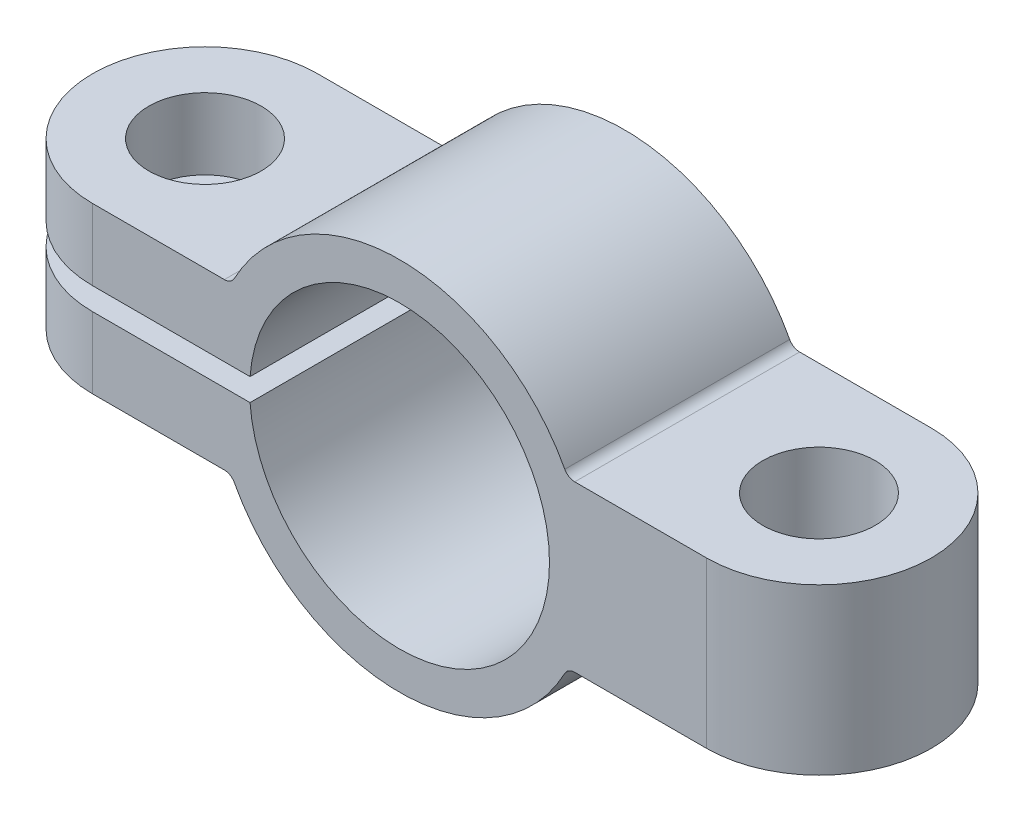
ISO-10303-21;
HEADER;
FILE_DESCRIPTION(('STEP AP214'),'2;1');
FILE_NAME('part.step','',(''),(''),'','','');
FILE_SCHEMA(('AUTOMOTIVE_DESIGN { 1 0 10303 214 1 1 1 1 }'));
ENDSEC;
DATA;
#1=APPLICATION_CONTEXT('core data for automotive mechanical design processes');
#2=APPLICATION_PROTOCOL_DEFINITION('international standard','automotive_design',2000,#1);
#3=PRODUCT_CONTEXT('',#1,'mechanical');
#4=PRODUCT('Part','Part','',(#3));
#5=PRODUCT_RELATED_PRODUCT_CATEGORY('part','',(#4));
#6=PRODUCT_DEFINITION_FORMATION('','',#4);
#7=PRODUCT_DEFINITION_CONTEXT('part definition',#1,'design');
#8=PRODUCT_DEFINITION('design','',#6,#7);
#9=PRODUCT_DEFINITION_SHAPE('','',#8);
#10=(LENGTH_UNIT() NAMED_UNIT(*) SI_UNIT(.MILLI.,.METRE.));
#11=(NAMED_UNIT(*) PLANE_ANGLE_UNIT() SI_UNIT($,.RADIAN.));
#12=(NAMED_UNIT(*) SI_UNIT($,.STERADIAN.) SOLID_ANGLE_UNIT());
#13=UNCERTAINTY_MEASURE_WITH_UNIT(LENGTH_MEASURE(1.E-05),#10,'distance_accuracy_value','');
#14=(GEOMETRIC_REPRESENTATION_CONTEXT(3) GLOBAL_UNCERTAINTY_ASSIGNED_CONTEXT((#13)) GLOBAL_UNIT_ASSIGNED_CONTEXT((#10,
#11,#12)) REPRESENTATION_CONTEXT('',''));
#15=CARTESIAN_POINT('',(0.,0.,0.));
#16=DIRECTION('',(0.,0.,1.));
#17=DIRECTION('',(1.,0.,0.));
#18=AXIS2_PLACEMENT_3D('',#15,#16,#17);
#19=CARTESIAN_POINT('',(0.,0.,6.));
#20=DIRECTION('',(0.,0.,-1.));
#21=DIRECTION('',(-1.,0.,0.));
#22=AXIS2_PLACEMENT_3D('',#19,#20,#21);
#23=PLANE('',#22);
#24=DIRECTION('',(0.,1.,0.));
#25=VECTOR('',#24,1.);
#26=CARTESIAN_POINT('',(8.18998886412873,-5.,6.));
#27=LINE('',#26,#25);
#28=CARTESIAN_POINT('',(8.18998886412873,-2.2,6.));
#29=VERTEX_POINT('',#28);
#30=CARTESIAN_POINT('',(8.18998886412873,2.2,6.));
#31=VERTEX_POINT('',#30);
#32=EDGE_CURVE('E150',#29,#31,#27,.T.);
#33=ORIENTED_EDGE('',*,*,#32,.T.);
#34=DIRECTION('',(-1.,0.,0.));
#35=VECTOR('',#34,1.);
#36=CARTESIAN_POINT('',(4.48998886412873,2.2,6.));
#37=LINE('',#36,#35);
#38=CARTESIAN_POINT('',(4.67332857821917,2.2,6.));
#39=VERTEX_POINT('',#38);
#40=EDGE_CURVE('E160',#31,#39,#37,.T.);
#41=ORIENTED_EDGE('',*,*,#40,.T.);
#42=CARTESIAN_POINT('',(4.67332857821917,2.5,6.));
#43=DIRECTION('',(0.,0.,-1.));
#44=DIRECTION('',(-1.,0.,0.));
#45=AXIS2_PLACEMENT_3D('',#42,#43,#44);
#46=CIRCLE('',#45,0.3);
#47=CARTESIAN_POINT('',(4.40880054548978,2.35849056603774,6.));
#48=VERTEX_POINT('',#47);
#49=EDGE_CURVE('E234',#39,#48,#46,.T.);
#50=ORIENTED_EDGE('',*,*,#49,.T.);
#51=CARTESIAN_POINT('',(0.,0.,6.));
#52=DIRECTION('',(0.,0.,1.));
#53=DIRECTION('',(-1.,0.,0.));
#54=AXIS2_PLACEMENT_3D('',#51,#52,#53);
#55=CIRCLE('',#54,5.);
#56=CARTESIAN_POINT('',(-4.40880054548978,2.35849056603774,6.));
#57=VERTEX_POINT('',#56);
#58=EDGE_CURVE('E169',#48,#57,#55,.T.);
#59=ORIENTED_EDGE('',*,*,#58,.T.);
#60=CARTESIAN_POINT('',(-4.67332857821917,2.5,6.));
#61=DIRECTION('',(0.,0.,-1.));
#62=DIRECTION('',(-1.,0.,0.));
#63=AXIS2_PLACEMENT_3D('',#60,#61,#62);
#64=CIRCLE('',#63,0.3);
#65=CARTESIAN_POINT('',(-4.67332857821917,2.2,6.));
#66=VERTEX_POINT('',#65);
#67=EDGE_CURVE('E11',#57,#66,#64,.T.);
#68=ORIENTED_EDGE('',*,*,#67,.T.);
#69=DIRECTION('',(-1.,0.,0.));
#70=VECTOR('',#69,1.);
#71=CARTESIAN_POINT('',(-11.1899888641287,2.2,6.));
#72=LINE('',#71,#70);
#73=CARTESIAN_POINT('',(-8.18998886412873,2.2,6.));
#74=VERTEX_POINT('',#73);
#75=EDGE_CURVE('E192',#66,#74,#72,.T.);
#76=ORIENTED_EDGE('',*,*,#75,.T.);
#77=DIRECTION('',(0.,1.,0.));
#78=VECTOR('',#77,1.);
#79=CARTESIAN_POINT('',(-8.18998886412873,-5.,6.));
#80=LINE('',#79,#78);
#81=CARTESIAN_POINT('',(-8.18998886412873,0.3,6.));
#82=VERTEX_POINT('',#81);
#83=EDGE_CURVE('E285',#82,#74,#80,.T.);
#84=ORIENTED_EDGE('',*,*,#83,.F.);
#85=DIRECTION('',(1.,0.,0.));
#86=VECTOR('',#85,1.);
#87=CARTESIAN_POINT('',(-11.1899888641287,0.3,6.));
#88=LINE('',#87,#86);
#89=CARTESIAN_POINT('',(-3.98873413503583,0.3,6.));
#90=VERTEX_POINT('',#89);
#91=EDGE_CURVE('E175',#82,#90,#88,.T.);
#92=ORIENTED_EDGE('',*,*,#91,.T.);
#93=CARTESIAN_POINT('',(0.,0.,6.));
#94=DIRECTION('',(0.,0.,-1.));
#95=DIRECTION('',(1.,0.,0.));
#96=AXIS2_PLACEMENT_3D('',#93,#94,#95);
#97=CIRCLE('',#96,4.);
#98=CARTESIAN_POINT('',(-3.98873413503583,-0.3,6.));
#99=VERTEX_POINT('',#98);
#100=EDGE_CURVE('E170',#90,#99,#97,.T.);
#101=ORIENTED_EDGE('',*,*,#100,.T.);
#102=DIRECTION('',(1.,0.,0.));
#103=VECTOR('',#102,1.);
#104=CARTESIAN_POINT('',(-11.1899888641287,-0.3,6.));
#105=LINE('',#104,#103);
#106=CARTESIAN_POINT('',(-8.18998886412873,-0.3,6.));
#107=VERTEX_POINT('',#106);
#108=EDGE_CURVE('E255',#107,#99,#105,.T.);
#109=ORIENTED_EDGE('',*,*,#108,.F.);
#110=CARTESIAN_POINT('',(-8.18998886412873,-2.2,6.));
#111=VERTEX_POINT('',#110);
#112=EDGE_CURVE('E284',#111,#107,#80,.T.);
#113=ORIENTED_EDGE('',*,*,#112,.F.);
#114=DIRECTION('',(-1.,0.,0.));
#115=VECTOR('',#114,1.);
#116=CARTESIAN_POINT('',(-11.1899888641287,-2.2,6.));
#117=LINE('',#116,#115);
#118=CARTESIAN_POINT('',(-4.67332857821917,-2.2,6.));
#119=VERTEX_POINT('',#118);
#120=EDGE_CURVE('E258',#119,#111,#117,.T.);
#121=ORIENTED_EDGE('',*,*,#120,.F.);
#122=CARTESIAN_POINT('',(-4.67332857821917,-2.5,6.));
#123=DIRECTION('',(0.,0.,-1.));
#124=DIRECTION('',(-1.,0.,0.));
#125=AXIS2_PLACEMENT_3D('',#122,#123,#124);
#126=CIRCLE('',#125,0.3);
#127=CARTESIAN_POINT('',(-4.40880054548978,-2.35849056603774,6.));
#128=VERTEX_POINT('',#127);
#129=EDGE_CURVE('E230',#119,#128,#126,.T.);
#130=ORIENTED_EDGE('',*,*,#129,.T.);
#131=CARTESIAN_POINT('',(0.,0.,6.));
#132=DIRECTION('',(0.,0.,-1.));
#133=DIRECTION('',(-1.,0.,0.));
#134=AXIS2_PLACEMENT_3D('',#131,#132,#133);
#135=CIRCLE('',#134,5.);
#136=CARTESIAN_POINT('',(4.40880054548978,-2.35849056603774,6.));
#137=VERTEX_POINT('',#136);
#138=EDGE_CURVE('E270',#137,#128,#135,.T.);
#139=ORIENTED_EDGE('',*,*,#138,.F.);
#140=CARTESIAN_POINT('',(4.67332857821917,-2.5,6.));
#141=DIRECTION('',(0.,0.,-1.));
#142=DIRECTION('',(-1.,0.,0.));
#143=AXIS2_PLACEMENT_3D('',#140,#141,#142);
#144=CIRCLE('',#143,0.3);
#145=CARTESIAN_POINT('',(4.67332857821917,-2.2,6.));
#146=VERTEX_POINT('',#145);
#147=EDGE_CURVE('E226',#137,#146,#144,.T.);
#148=ORIENTED_EDGE('',*,*,#147,.T.);
#149=DIRECTION('',(-1.,0.,0.));
#150=VECTOR('',#149,1.);
#151=CARTESIAN_POINT('',(4.48998886412873,-2.2,6.));
#152=LINE('',#151,#150);
#153=EDGE_CURVE('E163',#29,#146,#152,.T.);
#154=ORIENTED_EDGE('',*,*,#153,.F.);
#155=EDGE_LOOP('',(#33,#41,#50,#59,#68,#76,#84,#92,#101,#109,#113,#121,#130,#139,#148,#154));
#156=FACE_BOUND('',#155,.T.);
#157=ADVANCED_FACE('F35',(#156),#23,.F.);
#158=CARTESIAN_POINT('',(0.,0.,0.));
#159=DIRECTION('',(0.,0.,-1.));
#160=DIRECTION('',(-1.,0.,0.));
#161=AXIS2_PLACEMENT_3D('',#158,#159,#160);
#162=PLANE('',#161);
#163=DIRECTION('',(-1.,0.,0.));
#164=VECTOR('',#163,1.);
#165=CARTESIAN_POINT('',(4.48998886412873,2.2,0.));
#166=LINE('',#165,#164);
#167=CARTESIAN_POINT('',(8.18998886412873,2.2,0.));
#168=VERTEX_POINT('',#167);
#169=CARTESIAN_POINT('',(4.67332857821917,2.2,0.));
#170=VERTEX_POINT('',#169);
#171=EDGE_CURVE('E187',#168,#170,#166,.T.);
#172=ORIENTED_EDGE('',*,*,#171,.F.);
#173=DIRECTION('',(0.,1.,0.));
#174=VECTOR('',#173,1.);
#175=CARTESIAN_POINT('',(8.18998886412873,-5.,0.));
#176=LINE('',#175,#174);
#177=CARTESIAN_POINT('',(8.18998886412873,-2.2,0.));
#178=VERTEX_POINT('',#177);
#179=EDGE_CURVE('E153',#178,#168,#176,.T.);
#180=ORIENTED_EDGE('',*,*,#179,.F.);
#181=DIRECTION('',(-1.,0.,0.));
#182=VECTOR('',#181,1.);
#183=CARTESIAN_POINT('',(4.48998886412873,-2.2,0.));
#184=LINE('',#183,#182);
#185=CARTESIAN_POINT('',(4.67332857821917,-2.2,0.));
#186=VERTEX_POINT('',#185);
#187=EDGE_CURVE('E259',#178,#186,#184,.T.);
#188=ORIENTED_EDGE('',*,*,#187,.T.);
#189=CARTESIAN_POINT('',(4.67332857821917,-2.5,0.));
#190=DIRECTION('',(0.,0.,-1.));
#191=DIRECTION('',(-1.,0.,0.));
#192=AXIS2_PLACEMENT_3D('',#189,#190,#191);
#193=CIRCLE('',#192,0.3);
#194=CARTESIAN_POINT('',(4.40880054548978,-2.35849056603774,0.));
#195=VERTEX_POINT('',#194);
#196=EDGE_CURVE('E224',#186,#195,#193,.F.);
#197=ORIENTED_EDGE('',*,*,#196,.T.);
#198=CARTESIAN_POINT('',(0.,0.,0.));
#199=DIRECTION('',(0.,0.,-1.));
#200=DIRECTION('',(-1.,0.,0.));
#201=AXIS2_PLACEMENT_3D('',#198,#199,#200);
#202=CIRCLE('',#201,5.);
#203=CARTESIAN_POINT('',(-4.40880054548978,-2.35849056603774,0.));
#204=VERTEX_POINT('',#203);
#205=EDGE_CURVE('E262',#195,#204,#202,.T.);
#206=ORIENTED_EDGE('',*,*,#205,.T.);
#207=CARTESIAN_POINT('',(-4.67332857821917,-2.5,0.));
#208=DIRECTION('',(0.,0.,-1.));
#209=DIRECTION('',(-1.,0.,0.));
#210=AXIS2_PLACEMENT_3D('',#207,#208,#209);
#211=CIRCLE('',#210,0.3);
#212=CARTESIAN_POINT('',(-4.67332857821917,-2.2,0.));
#213=VERTEX_POINT('',#212);
#214=EDGE_CURVE('E228',#204,#213,#211,.F.);
#215=ORIENTED_EDGE('',*,*,#214,.T.);
#216=DIRECTION('',(-1.,0.,0.));
#217=VECTOR('',#216,1.);
#218=CARTESIAN_POINT('',(-11.1899888641287,-2.2,0.));
#219=LINE('',#218,#217);
#220=CARTESIAN_POINT('',(-8.18998886412873,-2.2,0.));
#221=VERTEX_POINT('',#220);
#222=EDGE_CURVE('E265',#213,#221,#219,.T.);
#223=ORIENTED_EDGE('',*,*,#222,.T.);
#224=DIRECTION('',(0.,1.,0.));
#225=VECTOR('',#224,1.);
#226=CARTESIAN_POINT('',(-8.18998886412873,-5.,0.));
#227=LINE('',#226,#225);
#228=CARTESIAN_POINT('',(-8.18998886412873,-0.3,0.));
#229=VERTEX_POINT('',#228);
#230=EDGE_CURVE('E280',#221,#229,#227,.T.);
#231=ORIENTED_EDGE('',*,*,#230,.T.);
#232=DIRECTION('',(1.,0.,0.));
#233=VECTOR('',#232,1.);
#234=CARTESIAN_POINT('',(-11.1899888641287,-0.3,0.));
#235=LINE('',#234,#233);
#236=CARTESIAN_POINT('',(-3.98873413503583,-0.3,0.));
#237=VERTEX_POINT('',#236);
#238=EDGE_CURVE('E256',#229,#237,#235,.T.);
#239=ORIENTED_EDGE('',*,*,#238,.T.);
#240=CARTESIAN_POINT('',(0.,0.,0.));
#241=DIRECTION('',(0.,0.,-1.));
#242=DIRECTION('',(1.,0.,0.));
#243=AXIS2_PLACEMENT_3D('',#240,#241,#242);
#244=CIRCLE('',#243,4.);
#245=CARTESIAN_POINT('',(-3.98873413503583,0.3,0.));
#246=VERTEX_POINT('',#245);
#247=EDGE_CURVE('E184',#246,#237,#244,.T.);
#248=ORIENTED_EDGE('',*,*,#247,.F.);
#249=DIRECTION('',(1.,0.,0.));
#250=VECTOR('',#249,1.);
#251=CARTESIAN_POINT('',(-11.1899888641287,0.3,0.));
#252=LINE('',#251,#250);
#253=CARTESIAN_POINT('',(-8.18998886412873,0.3,0.));
#254=VERTEX_POINT('',#253);
#255=EDGE_CURVE('E181',#254,#246,#252,.T.);
#256=ORIENTED_EDGE('',*,*,#255,.F.);
#257=CARTESIAN_POINT('',(-8.18998886412873,2.2,0.));
#258=VERTEX_POINT('',#257);
#259=EDGE_CURVE('E281',#254,#258,#227,.T.);
#260=ORIENTED_EDGE('',*,*,#259,.T.);
#261=DIRECTION('',(-1.,0.,0.));
#262=VECTOR('',#261,1.);
#263=CARTESIAN_POINT('',(-11.1899888641287,2.2,0.));
#264=LINE('',#263,#262);
#265=CARTESIAN_POINT('',(-4.67332857821917,2.2,0.));
#266=VERTEX_POINT('',#265);
#267=EDGE_CURVE('E179',#266,#258,#264,.T.);
#268=ORIENTED_EDGE('',*,*,#267,.F.);
#269=CARTESIAN_POINT('',(-4.67332857821917,2.5,0.));
#270=DIRECTION('',(0.,0.,-1.));
#271=DIRECTION('',(-1.,0.,0.));
#272=AXIS2_PLACEMENT_3D('',#269,#270,#271);
#273=CIRCLE('',#272,0.3);
#274=CARTESIAN_POINT('',(-4.40880054548978,2.35849056603774,0.));
#275=VERTEX_POINT('',#274);
#276=EDGE_CURVE('E43',#266,#275,#273,.F.);
#277=ORIENTED_EDGE('',*,*,#276,.T.);
#278=CARTESIAN_POINT('',(0.,0.,0.));
#279=DIRECTION('',(0.,0.,1.));
#280=DIRECTION('',(-1.,0.,0.));
#281=AXIS2_PLACEMENT_3D('',#278,#279,#280);
#282=CIRCLE('',#281,5.);
#283=CARTESIAN_POINT('',(4.40880054548978,2.35849056603774,0.));
#284=VERTEX_POINT('',#283);
#285=EDGE_CURVE('E189',#284,#275,#282,.T.);
#286=ORIENTED_EDGE('',*,*,#285,.F.);
#287=CARTESIAN_POINT('',(4.67332857821917,2.5,0.));
#288=DIRECTION('',(0.,0.,-1.));
#289=DIRECTION('',(-1.,0.,0.));
#290=AXIS2_PLACEMENT_3D('',#287,#288,#289);
#291=CIRCLE('',#290,0.3);
#292=EDGE_CURVE('E232',#284,#170,#291,.F.);
#293=ORIENTED_EDGE('',*,*,#292,.T.);
#294=EDGE_LOOP('',(#172,#180,#188,#197,#206,#215,#223,#231,#239,#248,#256,#260,#268,#277,#286,#293));
#295=FACE_BOUND('',#294,.T.);
#296=ADVANCED_FACE('F238',(#295),#162,.T.);
#297=CARTESIAN_POINT('',(-11.1899888641287,2.2,6.));
#298=DIRECTION('',(0.,-1.,0.));
#299=DIRECTION('',(0.,0.,-1.));
#300=AXIS2_PLACEMENT_3D('',#297,#298,#299);
#301=PLANE('',#300);
#302=CARTESIAN_POINT('',(-8.18998886412873,2.2,3.));
#303=DIRECTION('',(0.,1.,0.));
#304=DIRECTION('',(-1.,0.,0.));
#305=AXIS2_PLACEMENT_3D('',#302,#303,#304);
#306=CIRCLE('',#305,1.5);
#307=CARTESIAN_POINT('',(-9.68998886412873,2.2,3.));
#308=VERTEX_POINT('',#307);
#309=EDGE_CURVE('E202',#308,#308,#306,.T.);
#310=ORIENTED_EDGE('',*,*,#309,.F.);
#311=EDGE_LOOP('',(#310));
#312=FACE_BOUND('',#311,.T.);
#313=ORIENTED_EDGE('',*,*,#75,.F.);
#314=DIRECTION('',(0.,0.,1.));
#315=VECTOR('',#314,1.);
#316=CARTESIAN_POINT('',(-4.67332857821917,2.2,0.));
#317=LINE('',#316,#315);
#318=EDGE_CURVE('E222',#66,#266,#317,.F.);
#319=ORIENTED_EDGE('',*,*,#318,.T.);
#320=ORIENTED_EDGE('',*,*,#267,.T.);
#321=CARTESIAN_POINT('',(-8.18998886412873,2.2,3.));
#322=DIRECTION('',(0.,1.,0.));
#323=DIRECTION('',(-1.,0.,0.));
#324=AXIS2_PLACEMENT_3D('',#321,#322,#323);
#325=CIRCLE('',#324,3.);
#326=EDGE_CURVE('E248',#258,#74,#325,.T.);
#327=ORIENTED_EDGE('',*,*,#326,.T.);
#328=EDGE_LOOP('',(#313,#319,#320,#327));
#329=FACE_BOUND('',#328,.T.);
#330=ADVANCED_FACE('F245',(#312,#329),#301,.F.);
#331=CARTESIAN_POINT('',(-11.1899888641287,0.3,6.));
#332=DIRECTION('',(0.,1.,0.));
#333=DIRECTION('',(0.,0.,1.));
#334=AXIS2_PLACEMENT_3D('',#331,#332,#333);
#335=PLANE('',#334);
#336=CARTESIAN_POINT('',(-8.18998886412873,0.3,3.));
#337=DIRECTION('',(0.,1.,0.));
#338=DIRECTION('',(0.,0.,1.));
#339=AXIS2_PLACEMENT_3D('',#336,#337,#338);
#340=CIRCLE('',#339,1.5);
#341=CARTESIAN_POINT('',(-8.18998886412873,0.3,4.5));
#342=VERTEX_POINT('',#341);
#343=EDGE_CURVE('E164',#342,#342,#340,.T.);
#344=ORIENTED_EDGE('',*,*,#343,.T.);
#345=EDGE_LOOP('',(#344));
#346=FACE_BOUND('',#345,.T.);
#347=ORIENTED_EDGE('',*,*,#91,.F.);
#348=CARTESIAN_POINT('',(-8.18998886412873,0.3,3.));
#349=DIRECTION('',(0.,1.,0.));
#350=DIRECTION('',(0.,0.,1.));
#351=AXIS2_PLACEMENT_3D('',#348,#349,#350);
#352=CIRCLE('',#351,3.);
#353=EDGE_CURVE('E267',#254,#82,#352,.T.);
#354=ORIENTED_EDGE('',*,*,#353,.F.);
#355=ORIENTED_EDGE('',*,*,#255,.T.);
#356=DIRECTION('',(0.,0.,-1.));
#357=VECTOR('',#356,1.);
#358=CARTESIAN_POINT('',(-3.98873413503583,0.3,6.));
#359=LINE('',#358,#357);
#360=EDGE_CURVE('E172',#90,#246,#359,.T.);
#361=ORIENTED_EDGE('',*,*,#360,.F.);
#362=EDGE_LOOP('',(#347,#354,#355,#361));
#363=FACE_BOUND('',#362,.T.);
#364=ADVANCED_FACE('F321',(#346,#363),#335,.F.);
#365=CARTESIAN_POINT('',(-11.1899888641287,-2.2,6.));
#366=DIRECTION('',(0.,-1.,0.));
#367=DIRECTION('',(0.,0.,-1.));
#368=AXIS2_PLACEMENT_3D('',#365,#366,#367);
#369=PLANE('',#368);
#370=CARTESIAN_POINT('',(-8.18998886412873,-2.2,3.));
#371=DIRECTION('',(0.,-1.,0.));
#372=DIRECTION('',(0.,0.,-1.));
#373=AXIS2_PLACEMENT_3D('',#370,#371,#372);
#374=CIRCLE('',#373,1.5);
#375=CARTESIAN_POINT('',(-8.18998886412873,-2.2,1.5));
#376=VERTEX_POINT('',#375);
#377=EDGE_CURVE('E201',#376,#376,#374,.T.);
#378=ORIENTED_EDGE('',*,*,#377,.F.);
#379=EDGE_LOOP('',(#378));
#380=FACE_BOUND('',#379,.T.);
#381=ORIENTED_EDGE('',*,*,#222,.F.);
#382=DIRECTION('',(0.,0.,1.));
#383=VECTOR('',#382,1.);
#384=CARTESIAN_POINT('',(-4.67332857821917,-2.2,6.));
#385=LINE('',#384,#383);
#386=EDGE_CURVE('E214',#213,#119,#385,.T.);
#387=ORIENTED_EDGE('',*,*,#386,.T.);
#388=ORIENTED_EDGE('',*,*,#120,.T.);
#389=CARTESIAN_POINT('',(-8.18998886412873,-2.2,3.));
#390=DIRECTION('',(0.,-1.,0.));
#391=DIRECTION('',(0.,0.,-1.));
#392=AXIS2_PLACEMENT_3D('',#389,#390,#391);
#393=CIRCLE('',#392,3.);
#394=EDGE_CURVE('E275',#111,#221,#393,.T.);
#395=ORIENTED_EDGE('',*,*,#394,.T.);
#396=EDGE_LOOP('',(#381,#387,#388,#395));
#397=FACE_BOUND('',#396,.T.);
#398=ADVANCED_FACE('F318',(#380,#397),#369,.T.);
#399=CARTESIAN_POINT('',(-11.1899888641287,-0.3,6.));
#400=DIRECTION('',(0.,1.,0.));
#401=DIRECTION('',(0.,0.,1.));
#402=AXIS2_PLACEMENT_3D('',#399,#400,#401);
#403=PLANE('',#402);
#404=CARTESIAN_POINT('',(-8.18998886412873,-0.3,3.));
#405=DIRECTION('',(0.,1.,0.));
#406=DIRECTION('',(0.,0.,1.));
#407=AXIS2_PLACEMENT_3D('',#404,#405,#406);
#408=CIRCLE('',#407,1.5);
#409=CARTESIAN_POINT('',(-8.18998886412873,-0.3,4.5));
#410=VERTEX_POINT('',#409);
#411=EDGE_CURVE('E198',#410,#410,#408,.T.);
#412=ORIENTED_EDGE('',*,*,#411,.F.);
#413=EDGE_LOOP('',(#412));
#414=FACE_BOUND('',#413,.T.);
#415=CARTESIAN_POINT('',(-8.18998886412873,-0.3,3.));
#416=DIRECTION('',(0.,1.,0.));
#417=DIRECTION('',(0.,0.,1.));
#418=AXIS2_PLACEMENT_3D('',#415,#416,#417);
#419=CIRCLE('',#418,3.);
#420=EDGE_CURVE('E278',#229,#107,#419,.T.);
#421=ORIENTED_EDGE('',*,*,#420,.T.);
#422=ORIENTED_EDGE('',*,*,#108,.T.);
#423=DIRECTION('',(0.,0.,-1.));
#424=VECTOR('',#423,1.);
#425=CARTESIAN_POINT('',(-3.98873413503583,-0.3,6.));
#426=LINE('',#425,#424);
#427=EDGE_CURVE('E182',#99,#237,#426,.T.);
#428=ORIENTED_EDGE('',*,*,#427,.T.);
#429=ORIENTED_EDGE('',*,*,#238,.F.);
#430=EDGE_LOOP('',(#421,#422,#428,#429));
#431=FACE_BOUND('',#430,.T.);
#432=ADVANCED_FACE('F308',(#414,#431),#403,.T.);
#433=CARTESIAN_POINT('',(0.,0.,6.));
#434=DIRECTION('',(0.,0.,-1.));
#435=DIRECTION('',(-1.,0.,0.));
#436=AXIS2_PLACEMENT_3D('',#433,#434,#435);
#437=CYLINDRICAL_SURFACE('',#436,4.);
#438=ORIENTED_EDGE('',*,*,#247,.T.);
#439=ORIENTED_EDGE('',*,*,#427,.F.);
#440=ORIENTED_EDGE('',*,*,#100,.F.);
#441=ORIENTED_EDGE('',*,*,#360,.T.);
#442=EDGE_LOOP('',(#438,#439,#440,#441));
#443=FACE_BOUND('',#442,.T.);
#444=ADVANCED_FACE('F300',(#443),#437,.F.);
#445=CARTESIAN_POINT('',(4.48998886412873,2.2,6.));
#446=DIRECTION('',(0.,-1.,0.));
#447=DIRECTION('',(0.,0.,-1.));
#448=AXIS2_PLACEMENT_3D('',#445,#446,#447);
#449=PLANE('',#448);
#450=CARTESIAN_POINT('',(8.18998886412873,2.2,3.));
#451=DIRECTION('',(0.,1.,0.));
#452=DIRECTION('',(-1.,0.,0.));
#453=AXIS2_PLACEMENT_3D('',#450,#451,#452);
#454=CIRCLE('',#453,1.5);
#455=CARTESIAN_POINT('',(6.68998886412873,2.2,3.));
#456=VERTEX_POINT('',#455);
#457=EDGE_CURVE('E206',#456,#456,#454,.T.);
#458=ORIENTED_EDGE('',*,*,#457,.F.);
#459=EDGE_LOOP('',(#458));
#460=FACE_BOUND('',#459,.T.);
#461=ORIENTED_EDGE('',*,*,#171,.T.);
#462=DIRECTION('',(0.,0.,1.));
#463=VECTOR('',#462,1.);
#464=CARTESIAN_POINT('',(4.67332857821917,2.2,6.));
#465=LINE('',#464,#463);
#466=EDGE_CURVE('E168',#170,#39,#465,.T.);
#467=ORIENTED_EDGE('',*,*,#466,.T.);
#468=ORIENTED_EDGE('',*,*,#40,.F.);
#469=CARTESIAN_POINT('',(8.18998886412873,2.2,3.));
#470=DIRECTION('',(0.,-1.,0.));
#471=DIRECTION('',(1.,0.,0.));
#472=AXIS2_PLACEMENT_3D('',#469,#470,#471);
#473=CIRCLE('',#472,3.);
#474=EDGE_CURVE('E147',#168,#31,#473,.T.);
#475=ORIENTED_EDGE('',*,*,#474,.F.);
#476=EDGE_LOOP('',(#461,#467,#468,#475));
#477=FACE_BOUND('',#476,.T.);
#478=ADVANCED_FACE('F166',(#460,#477),#449,.F.);
#479=CARTESIAN_POINT('',(0.,0.,6.));
#480=DIRECTION('',(0.,0.,-1.));
#481=DIRECTION('',(-1.,0.,0.));
#482=AXIS2_PLACEMENT_3D('',#479,#480,#481);
#483=CYLINDRICAL_SURFACE('',#482,5.);
#484=ORIENTED_EDGE('',*,*,#58,.F.);
#485=DIRECTION('',(0.,0.,-1.));
#486=VECTOR('',#485,1.);
#487=CARTESIAN_POINT('',(4.40880054548978,2.35849056603774,6.));
#488=LINE('',#487,#486);
#489=EDGE_CURVE('E218',#48,#284,#488,.T.);
#490=ORIENTED_EDGE('',*,*,#489,.T.);
#491=ORIENTED_EDGE('',*,*,#285,.T.);
#492=DIRECTION('',(0.,0.,-1.));
#493=VECTOR('',#492,1.);
#494=CARTESIAN_POINT('',(-4.40880054548978,2.35849056603774,6.));
#495=LINE('',#494,#493);
#496=EDGE_CURVE('E216',#275,#57,#495,.F.);
#497=ORIENTED_EDGE('',*,*,#496,.T.);
#498=EDGE_LOOP('',(#484,#490,#491,#497));
#499=FACE_BOUND('',#498,.T.);
#500=ADVANCED_FACE('F242',(#499),#483,.T.);
#501=CARTESIAN_POINT('',(0.,0.,6.));
#502=DIRECTION('',(0.,0.,-1.));
#503=DIRECTION('',(-1.,0.,0.));
#504=AXIS2_PLACEMENT_3D('',#501,#502,#503);
#505=CYLINDRICAL_SURFACE('',#504,5.);
#506=ORIENTED_EDGE('',*,*,#205,.F.);
#507=DIRECTION('',(0.,0.,-1.));
#508=VECTOR('',#507,1.);
#509=CARTESIAN_POINT('',(4.40880054548978,-2.35849056603774,6.));
#510=LINE('',#509,#508);
#511=EDGE_CURVE('E212',#195,#137,#510,.F.);
#512=ORIENTED_EDGE('',*,*,#511,.T.);
#513=ORIENTED_EDGE('',*,*,#138,.T.);
#514=DIRECTION('',(0.,0.,-1.));
#515=VECTOR('',#514,1.);
#516=CARTESIAN_POINT('',(-4.40880054548978,-2.35849056603774,6.));
#517=LINE('',#516,#515);
#518=EDGE_CURVE('E209',#128,#204,#517,.T.);
#519=ORIENTED_EDGE('',*,*,#518,.T.);
#520=EDGE_LOOP('',(#506,#512,#513,#519));
#521=FACE_BOUND('',#520,.T.);
#522=ADVANCED_FACE('F306',(#521),#505,.T.);
#523=CARTESIAN_POINT('',(4.48998886412873,-2.2,6.));
#524=DIRECTION('',(0.,-1.,0.));
#525=DIRECTION('',(0.,0.,-1.));
#526=AXIS2_PLACEMENT_3D('',#523,#524,#525);
#527=PLANE('',#526);
#528=CARTESIAN_POINT('',(8.18998886412873,-2.2,3.));
#529=DIRECTION('',(0.,-1.,0.));
#530=DIRECTION('',(0.,0.,-1.));
#531=AXIS2_PLACEMENT_3D('',#528,#529,#530);
#532=CIRCLE('',#531,1.5);
#533=CARTESIAN_POINT('',(8.18998886412873,-2.2,1.5));
#534=VERTEX_POINT('',#533);
#535=EDGE_CURVE('E203',#534,#534,#532,.T.);
#536=ORIENTED_EDGE('',*,*,#535,.F.);
#537=EDGE_LOOP('',(#536));
#538=FACE_BOUND('',#537,.T.);
#539=ORIENTED_EDGE('',*,*,#153,.T.);
#540=DIRECTION('',(0.,0.,1.));
#541=VECTOR('',#540,1.);
#542=CARTESIAN_POINT('',(4.67332857821917,-2.2,0.));
#543=LINE('',#542,#541);
#544=EDGE_CURVE('E197',#146,#186,#543,.F.);
#545=ORIENTED_EDGE('',*,*,#544,.T.);
#546=ORIENTED_EDGE('',*,*,#187,.F.);
#547=CARTESIAN_POINT('',(8.18998886412873,-2.2,3.));
#548=DIRECTION('',(0.,-1.,0.));
#549=DIRECTION('',(0.,0.,-1.));
#550=AXIS2_PLACEMENT_3D('',#547,#548,#549);
#551=CIRCLE('',#550,3.);
#552=EDGE_CURVE('E195',#29,#178,#551,.F.);
#553=ORIENTED_EDGE('',*,*,#552,.F.);
#554=EDGE_LOOP('',(#539,#545,#546,#553));
#555=FACE_BOUND('',#554,.T.);
#556=ADVANCED_FACE('F325',(#538,#555),#527,.T.);
#557=CARTESIAN_POINT('',(-8.18998886412873,-5.,3.));
#558=DIRECTION('',(0.,1.,0.));
#559=DIRECTION('',(-1.,0.,0.));
#560=AXIS2_PLACEMENT_3D('',#557,#558,#559);
#561=CYLINDRICAL_SURFACE('',#560,3.);
#562=ORIENTED_EDGE('',*,*,#394,.F.);
#563=ORIENTED_EDGE('',*,*,#112,.T.);
#564=ORIENTED_EDGE('',*,*,#420,.F.);
#565=ORIENTED_EDGE('',*,*,#230,.F.);
#566=EDGE_LOOP('',(#562,#563,#564,#565));
#567=FACE_BOUND('',#566,.T.);
#568=ADVANCED_FACE('F329',(#567),#561,.T.);
#569=ORIENTED_EDGE('',*,*,#353,.T.);
#570=ORIENTED_EDGE('',*,*,#83,.T.);
#571=ORIENTED_EDGE('',*,*,#326,.F.);
#572=ORIENTED_EDGE('',*,*,#259,.F.);
#573=EDGE_LOOP('',(#569,#570,#571,#572));
#574=FACE_BOUND('',#573,.T.);
#575=ADVANCED_FACE('F336',(#574),#561,.T.);
#576=CARTESIAN_POINT('',(8.18998886412873,-5.,3.));
#577=DIRECTION('',(0.,1.,0.));
#578=DIRECTION('',(-1.,0.,0.));
#579=AXIS2_PLACEMENT_3D('',#576,#577,#578);
#580=CYLINDRICAL_SURFACE('',#579,3.);
#581=ORIENTED_EDGE('',*,*,#552,.T.);
#582=ORIENTED_EDGE('',*,*,#179,.T.);
#583=ORIENTED_EDGE('',*,*,#474,.T.);
#584=ORIENTED_EDGE('',*,*,#32,.F.);
#585=EDGE_LOOP('',(#581,#582,#583,#584));
#586=FACE_BOUND('',#585,.T.);
#587=ADVANCED_FACE('F149',(#586),#580,.T.);
#588=CARTESIAN_POINT('',(-8.18998886412873,-5.,3.));
#589=DIRECTION('',(0.,1.,0.));
#590=DIRECTION('',(-1.,0.,0.));
#591=AXIS2_PLACEMENT_3D('',#588,#589,#590);
#592=CYLINDRICAL_SURFACE('',#591,1.5);
#593=ORIENTED_EDGE('',*,*,#377,.T.);
#594=EDGE_LOOP('',(#593));
#595=FACE_BOUND('',#594,.T.);
#596=ORIENTED_EDGE('',*,*,#411,.T.);
#597=EDGE_LOOP('',(#596));
#598=FACE_BOUND('',#597,.T.);
#599=ADVANCED_FACE('F340',(#595,#598),#592,.F.);
#600=ORIENTED_EDGE('',*,*,#309,.T.);
#601=EDGE_LOOP('',(#600));
#602=FACE_BOUND('',#601,.T.);
#603=ORIENTED_EDGE('',*,*,#343,.F.);
#604=EDGE_LOOP('',(#603));
#605=FACE_BOUND('',#604,.T.);
#606=ADVANCED_FACE('F343',(#602,#605),#592,.F.);
#607=CARTESIAN_POINT('',(8.18998886412873,-5.,3.));
#608=DIRECTION('',(0.,1.,0.));
#609=DIRECTION('',(-1.,0.,0.));
#610=AXIS2_PLACEMENT_3D('',#607,#608,#609);
#611=CYLINDRICAL_SURFACE('',#610,1.5);
#612=ORIENTED_EDGE('',*,*,#535,.T.);
#613=EDGE_LOOP('',(#612));
#614=FACE_BOUND('',#613,.T.);
#615=ORIENTED_EDGE('',*,*,#457,.T.);
#616=EDGE_LOOP('',(#615));
#617=FACE_BOUND('',#616,.T.);
#618=ADVANCED_FACE('F297',(#614,#617),#611,.F.);
#619=CARTESIAN_POINT('',(4.67332857821917,-2.5,6.));
#620=DIRECTION('',(0.,0.,-1.));
#621=DIRECTION('',(-1.,0.,0.));
#622=AXIS2_PLACEMENT_3D('',#619,#620,#621);
#623=CYLINDRICAL_SURFACE('',#622,0.3);
#624=ORIENTED_EDGE('',*,*,#147,.F.);
#625=ORIENTED_EDGE('',*,*,#511,.F.);
#626=ORIENTED_EDGE('',*,*,#196,.F.);
#627=ORIENTED_EDGE('',*,*,#544,.F.);
#628=EDGE_LOOP('',(#624,#625,#626,#627));
#629=FACE_BOUND('',#628,.T.);
#630=ADVANCED_FACE('F346',(#629),#623,.F.);
#631=CARTESIAN_POINT('',(-4.67332857821917,-2.5,6.));
#632=DIRECTION('',(0.,0.,-1.));
#633=DIRECTION('',(-1.,0.,0.));
#634=AXIS2_PLACEMENT_3D('',#631,#632,#633);
#635=CYLINDRICAL_SURFACE('',#634,0.3);
#636=ORIENTED_EDGE('',*,*,#129,.F.);
#637=ORIENTED_EDGE('',*,*,#386,.F.);
#638=ORIENTED_EDGE('',*,*,#214,.F.);
#639=ORIENTED_EDGE('',*,*,#518,.F.);
#640=EDGE_LOOP('',(#636,#637,#638,#639));
#641=FACE_BOUND('',#640,.T.);
#642=ADVANCED_FACE('F352',(#641),#635,.F.);
#643=CARTESIAN_POINT('',(4.67332857821917,2.5,6.));
#644=DIRECTION('',(0.,0.,-1.));
#645=DIRECTION('',(-1.,0.,0.));
#646=AXIS2_PLACEMENT_3D('',#643,#644,#645);
#647=CYLINDRICAL_SURFACE('',#646,0.3);
#648=ORIENTED_EDGE('',*,*,#49,.F.);
#649=ORIENTED_EDGE('',*,*,#466,.F.);
#650=ORIENTED_EDGE('',*,*,#292,.F.);
#651=ORIENTED_EDGE('',*,*,#489,.F.);
#652=EDGE_LOOP('',(#648,#649,#650,#651));
#653=FACE_BOUND('',#652,.T.);
#654=ADVANCED_FACE('F481',(#653),#647,.F.);
#655=CARTESIAN_POINT('',(-4.67332857821917,2.5,6.));
#656=DIRECTION('',(0.,0.,-1.));
#657=DIRECTION('',(-1.,0.,0.));
#658=AXIS2_PLACEMENT_3D('',#655,#656,#657);
#659=CYLINDRICAL_SURFACE('',#658,0.3);
#660=ORIENTED_EDGE('',*,*,#67,.F.);
#661=ORIENTED_EDGE('',*,*,#496,.F.);
#662=ORIENTED_EDGE('',*,*,#276,.F.);
#663=ORIENTED_EDGE('',*,*,#318,.F.);
#664=EDGE_LOOP('',(#660,#661,#662,#663));
#665=FACE_BOUND('',#664,.T.);
#666=ADVANCED_FACE('F37',(#665),#659,.F.);
#667=CLOSED_SHELL('',(#157,#296,#330,#364,#398,#432,#444,#478,#500,#522,#556,#568,#575,#587,
#599,#606,#618,#630,#642,#654,#666));
#668=MANIFOLD_SOLID_BREP('B2',#667);
#669=ADVANCED_BREP_SHAPE_REPRESENTATION('',(#18,#668),#14);
#670=SHAPE_DEFINITION_REPRESENTATION(#9,#669);
ENDSEC;
END-ISO-10303-21;
